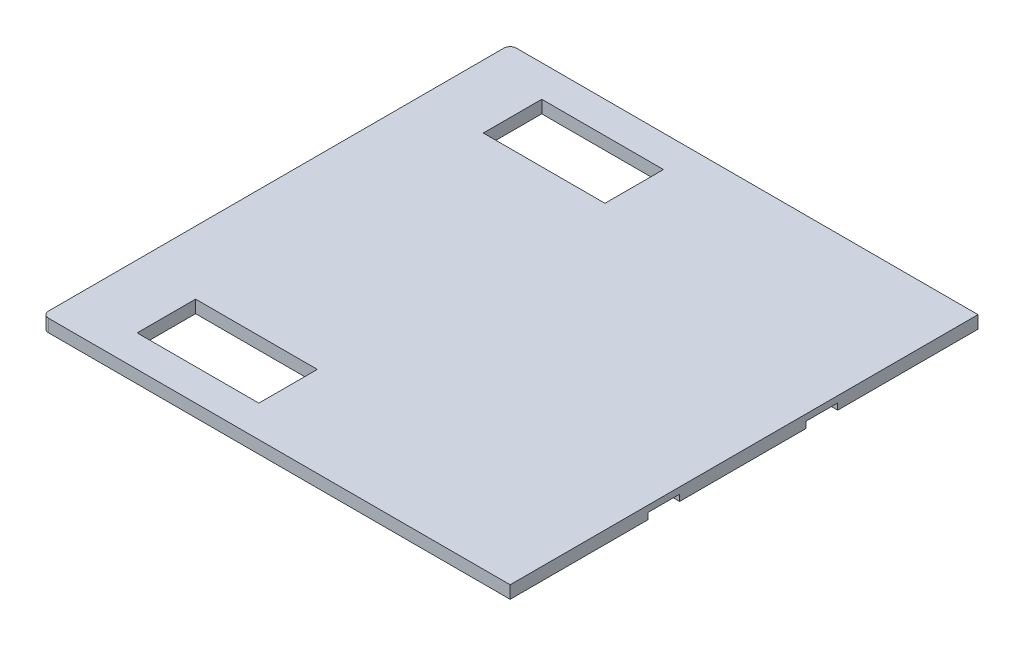
ISO-10303-21;
HEADER;
FILE_DESCRIPTION(('STEP AP214'),'2;1');
FILE_NAME('part.step','',(''),(''),'','','');
FILE_SCHEMA(('AUTOMOTIVE_DESIGN { 1 0 10303 214 1 1 1 1 }'));
ENDSEC;
DATA;
#1=APPLICATION_CONTEXT('core data for automotive mechanical design processes');
#2=APPLICATION_PROTOCOL_DEFINITION('international standard','automotive_design',2000,#1);
#3=PRODUCT_CONTEXT('',#1,'mechanical');
#4=PRODUCT('Part','Part','',(#3));
#5=PRODUCT_RELATED_PRODUCT_CATEGORY('part','',(#4));
#6=PRODUCT_DEFINITION_FORMATION('','',#4);
#7=PRODUCT_DEFINITION_CONTEXT('part definition',#1,'design');
#8=PRODUCT_DEFINITION('design','',#6,#7);
#9=PRODUCT_DEFINITION_SHAPE('','',#8);
#10=(LENGTH_UNIT() NAMED_UNIT(*) SI_UNIT(.MILLI.,.METRE.));
#11=(NAMED_UNIT(*) PLANE_ANGLE_UNIT() SI_UNIT($,.RADIAN.));
#12=(NAMED_UNIT(*) SI_UNIT($,.STERADIAN.) SOLID_ANGLE_UNIT());
#13=UNCERTAINTY_MEASURE_WITH_UNIT(LENGTH_MEASURE(1.E-05),#10,'distance_accuracy_value','');
#14=(GEOMETRIC_REPRESENTATION_CONTEXT(3) GLOBAL_UNCERTAINTY_ASSIGNED_CONTEXT((#13)) GLOBAL_UNIT_ASSIGNED_CONTEXT((#10,
#11,#12)) REPRESENTATION_CONTEXT('',''));
#15=CARTESIAN_POINT('',(0.,0.,0.));
#16=DIRECTION('',(0.,0.,1.));
#17=DIRECTION('',(1.,0.,0.));
#18=AXIS2_PLACEMENT_3D('',#15,#16,#17);
#19=CARTESIAN_POINT('',(0.,0.,0.));
#20=DIRECTION('',(0.,1.,0.));
#21=DIRECTION('',(0.,0.,1.));
#22=AXIS2_PLACEMENT_3D('',#19,#20,#21);
#23=PLANE('',#22);
#24=DIRECTION('',(0.,0.,1.));
#25=VECTOR('',#24,1.);
#26=CARTESIAN_POINT('',(-54.,0.,-64.));
#27=LINE('',#26,#25);
#28=CARTESIAN_POINT('',(-54.,0.,-64.));
#29=VERTEX_POINT('',#28);
#30=CARTESIAN_POINT('',(-54.,0.,-45.5));
#31=VERTEX_POINT('',#30);
#32=EDGE_CURVE('E56',#29,#31,#27,.T.);
#33=ORIENTED_EDGE('',*,*,#32,.T.);
#34=DIRECTION('',(1.,0.,0.));
#35=VECTOR('',#34,1.);
#36=CARTESIAN_POINT('',(-54.,0.,-45.5));
#37=LINE('',#36,#35);
#38=CARTESIAN_POINT('',(-15.5,0.,-45.5));
#39=VERTEX_POINT('',#38);
#40=EDGE_CURVE('E215',#31,#39,#37,.T.);
#41=ORIENTED_EDGE('',*,*,#40,.T.);
#42=DIRECTION('',(0.,0.,-1.));
#43=VECTOR('',#42,1.);
#44=CARTESIAN_POINT('',(-15.5,0.,-64.));
#45=LINE('',#44,#43);
#46=CARTESIAN_POINT('',(-15.5,0.,-64.));
#47=VERTEX_POINT('',#46);
#48=EDGE_CURVE('E218',#39,#47,#45,.T.);
#49=ORIENTED_EDGE('',*,*,#48,.T.);
#50=DIRECTION('',(-1.,0.,0.));
#51=VECTOR('',#50,1.);
#52=CARTESIAN_POINT('',(-54.,0.,-64.));
#53=LINE('',#52,#51);
#54=EDGE_CURVE('E221',#47,#29,#53,.T.);
#55=ORIENTED_EDGE('',*,*,#54,.T.);
#56=EDGE_LOOP('',(#33,#41,#49,#55));
#57=FACE_BOUND('',#56,.T.);
#58=DIRECTION('',(1.,0.,0.));
#59=VECTOR('',#58,1.);
#60=CARTESIAN_POINT('',(80.5611725248241,0.,30.3842184577749));
#61=LINE('',#60,#59);
#62=CARTESIAN_POINT('',(56.9201916936925,0.,30.3842184577749));
#63=VERTEX_POINT('',#62);
#64=CARTESIAN_POINT('',(74.,0.,30.3842184577749));
#65=VERTEX_POINT('',#64);
#66=EDGE_CURVE('E233',#63,#65,#61,.T.);
#67=ORIENTED_EDGE('',*,*,#66,.T.);
#68=DIRECTION('',(0.,0.,-1.));
#69=VECTOR('',#68,1.);
#70=CARTESIAN_POINT('',(74.,0.,-74.));
#71=LINE('',#70,#69);
#72=CARTESIAN_POINT('',(74.,0.,74.));
#73=VERTEX_POINT('',#72);
#74=EDGE_CURVE('E290',#73,#65,#71,.T.);
#75=ORIENTED_EDGE('',*,*,#74,.F.);
#76=DIRECTION('',(1.,0.,0.));
#77=VECTOR('',#76,1.);
#78=CARTESIAN_POINT('',(-74.,0.,74.));
#79=LINE('',#78,#77);
#80=CARTESIAN_POINT('',(-72.,0.,74.));
#81=VERTEX_POINT('',#80);
#82=EDGE_CURVE('E281',#81,#73,#79,.T.);
#83=ORIENTED_EDGE('',*,*,#82,.F.);
#84=CARTESIAN_POINT('',(-72.,0.,72.));
#85=DIRECTION('',(0.,1.,0.));
#86=DIRECTION('',(0.,0.,1.));
#87=AXIS2_PLACEMENT_3D('',#84,#85,#86);
#88=CIRCLE('',#87,2.);
#89=CARTESIAN_POINT('',(-74.,0.,72.));
#90=VERTEX_POINT('',#89);
#91=EDGE_CURVE('E311',#81,#90,#88,.F.);
#92=ORIENTED_EDGE('',*,*,#91,.T.);
#93=DIRECTION('',(0.,0.,1.));
#94=VECTOR('',#93,1.);
#95=CARTESIAN_POINT('',(-74.,0.,-74.));
#96=LINE('',#95,#94);
#97=CARTESIAN_POINT('',(-74.,0.,-72.));
#98=VERTEX_POINT('',#97);
#99=EDGE_CURVE('E297',#98,#90,#96,.T.);
#100=ORIENTED_EDGE('',*,*,#99,.F.);
#101=CARTESIAN_POINT('',(-72.,0.,-72.));
#102=DIRECTION('',(0.,1.,0.));
#103=DIRECTION('',(0.,0.,1.));
#104=AXIS2_PLACEMENT_3D('',#101,#102,#103);
#105=CIRCLE('',#104,2.);
#106=CARTESIAN_POINT('',(-72.,0.,-74.));
#107=VERTEX_POINT('',#106);
#108=EDGE_CURVE('E313',#98,#107,#105,.F.);
#109=ORIENTED_EDGE('',*,*,#108,.T.);
#110=DIRECTION('',(-1.,0.,0.));
#111=VECTOR('',#110,1.);
#112=CARTESIAN_POINT('',(-74.,0.,-74.));
#113=LINE('',#112,#111);
#114=CARTESIAN_POINT('',(74.,0.,-74.));
#115=VERTEX_POINT('',#114);
#116=EDGE_CURVE('E293',#115,#107,#113,.T.);
#117=ORIENTED_EDGE('',*,*,#116,.F.);
#118=CARTESIAN_POINT('',(74.,0.,-29.6157815422251));
#119=VERTEX_POINT('',#118);
#120=EDGE_CURVE('E276',#119,#115,#71,.T.);
#121=ORIENTED_EDGE('',*,*,#120,.F.);
#122=DIRECTION('',(1.,0.,0.));
#123=VECTOR('',#122,1.);
#124=CARTESIAN_POINT('',(0.,0.,-29.6157815422251));
#125=LINE('',#124,#123);
#126=CARTESIAN_POINT('',(56.9201916936925,0.,-29.6157815422251));
#127=VERTEX_POINT('',#126);
#128=EDGE_CURVE('E324',#127,#119,#125,.T.);
#129=ORIENTED_EDGE('',*,*,#128,.F.);
#130=DIRECTION('',(0.,0.,1.));
#131=VECTOR('',#130,1.);
#132=CARTESIAN_POINT('',(56.9201916936925,0.,-29.6157815422251));
#133=LINE('',#132,#131);
#134=CARTESIAN_POINT('',(56.9201916936925,0.,-19.6157815422251));
#135=VERTEX_POINT('',#134);
#136=EDGE_CURVE('E187',#127,#135,#133,.T.);
#137=ORIENTED_EDGE('',*,*,#136,.T.);
#138=DIRECTION('',(1.,0.,0.));
#139=VECTOR('',#138,1.);
#140=CARTESIAN_POINT('',(74.0521231631863,0.,-19.6157815422251));
#141=LINE('',#140,#139);
#142=CARTESIAN_POINT('',(74.,0.,-19.6157815422251));
#143=VERTEX_POINT('',#142);
#144=EDGE_CURVE('E255',#135,#143,#141,.T.);
#145=ORIENTED_EDGE('',*,*,#144,.T.);
#146=CARTESIAN_POINT('',(74.,0.,20.3842184577749));
#147=VERTEX_POINT('',#146);
#148=EDGE_CURVE('E294',#147,#143,#71,.T.);
#149=ORIENTED_EDGE('',*,*,#148,.F.);
#150=DIRECTION('',(1.,0.,0.));
#151=VECTOR('',#150,1.);
#152=CARTESIAN_POINT('',(0.,0.,20.3842184577749));
#153=LINE('',#152,#151);
#154=CARTESIAN_POINT('',(56.9201916936925,0.,20.3842184577749));
#155=VERTEX_POINT('',#154);
#156=EDGE_CURVE('E326',#155,#147,#153,.T.);
#157=ORIENTED_EDGE('',*,*,#156,.F.);
#158=DIRECTION('',(0.,0.,1.));
#159=VECTOR('',#158,1.);
#160=CARTESIAN_POINT('',(56.9201916936925,0.,20.3842184577749));
#161=LINE('',#160,#159);
#162=EDGE_CURVE('E239',#155,#63,#161,.T.);
#163=ORIENTED_EDGE('',*,*,#162,.T.);
#164=EDGE_LOOP('',(#67,#75,#83,#92,#100,#109,#117,#121,#129,#137,#145,#149,#157,#163));
#165=FACE_BOUND('',#164,.T.);
#166=DIRECTION('',(0.,0.,1.));
#167=VECTOR('',#166,1.);
#168=CARTESIAN_POINT('',(-54.,0.,64.));
#169=LINE('',#168,#167);
#170=CARTESIAN_POINT('',(-54.,0.,45.5));
#171=VERTEX_POINT('',#170);
#172=CARTESIAN_POINT('',(-54.,0.,64.));
#173=VERTEX_POINT('',#172);
#174=EDGE_CURVE('E48',#171,#173,#169,.T.);
#175=ORIENTED_EDGE('',*,*,#174,.T.);
#176=DIRECTION('',(1.,0.,0.));
#177=VECTOR('',#176,1.);
#178=CARTESIAN_POINT('',(-54.,0.,64.));
#179=LINE('',#178,#177);
#180=CARTESIAN_POINT('',(-15.5,0.,64.));
#181=VERTEX_POINT('',#180);
#182=EDGE_CURVE('E191',#173,#181,#179,.T.);
#183=ORIENTED_EDGE('',*,*,#182,.T.);
#184=DIRECTION('',(0.,0.,-1.));
#185=VECTOR('',#184,1.);
#186=CARTESIAN_POINT('',(-15.5,0.,64.));
#187=LINE('',#186,#185);
#188=CARTESIAN_POINT('',(-15.5,0.,45.5));
#189=VERTEX_POINT('',#188);
#190=EDGE_CURVE('E197',#181,#189,#187,.T.);
#191=ORIENTED_EDGE('',*,*,#190,.T.);
#192=DIRECTION('',(-1.,0.,0.));
#193=VECTOR('',#192,1.);
#194=CARTESIAN_POINT('',(-54.,0.,45.5));
#195=LINE('',#194,#193);
#196=EDGE_CURVE('E201',#189,#171,#195,.T.);
#197=ORIENTED_EDGE('',*,*,#196,.T.);
#198=EDGE_LOOP('',(#175,#183,#191,#197));
#199=FACE_BOUND('',#198,.T.);
#200=ADVANCED_FACE('F33',(#57,#165,#199),#23,.F.);
#201=CARTESIAN_POINT('',(0.,4.,0.));
#202=DIRECTION('',(0.,1.,0.));
#203=DIRECTION('',(0.,0.,1.));
#204=AXIS2_PLACEMENT_3D('',#201,#202,#203);
#205=PLANE('',#204);
#206=DIRECTION('',(-1.,0.,0.));
#207=VECTOR('',#206,1.);
#208=CARTESIAN_POINT('',(-74.,4.,-74.));
#209=LINE('',#208,#207);
#210=CARTESIAN_POINT('',(74.,4.,-74.));
#211=VERTEX_POINT('',#210);
#212=CARTESIAN_POINT('',(-72.,4.,-74.));
#213=VERTEX_POINT('',#212);
#214=EDGE_CURVE('E280',#211,#213,#209,.T.);
#215=ORIENTED_EDGE('',*,*,#214,.T.);
#216=CARTESIAN_POINT('',(-72.,4.,-72.));
#217=DIRECTION('',(0.,1.,0.));
#218=DIRECTION('',(0.,0.,1.));
#219=AXIS2_PLACEMENT_3D('',#216,#217,#218);
#220=CIRCLE('',#219,2.);
#221=CARTESIAN_POINT('',(-74.,4.,-72.));
#222=VERTEX_POINT('',#221);
#223=EDGE_CURVE('E319',#213,#222,#220,.T.);
#224=ORIENTED_EDGE('',*,*,#223,.T.);
#225=DIRECTION('',(0.,0.,1.));
#226=VECTOR('',#225,1.);
#227=CARTESIAN_POINT('',(-74.,4.,-74.));
#228=LINE('',#227,#226);
#229=CARTESIAN_POINT('',(-74.,4.,72.));
#230=VERTEX_POINT('',#229);
#231=EDGE_CURVE('E284',#222,#230,#228,.T.);
#232=ORIENTED_EDGE('',*,*,#231,.T.);
#233=CARTESIAN_POINT('',(-72.,4.,72.));
#234=DIRECTION('',(0.,1.,0.));
#235=DIRECTION('',(0.,0.,1.));
#236=AXIS2_PLACEMENT_3D('',#233,#234,#235);
#237=CIRCLE('',#236,2.);
#238=CARTESIAN_POINT('',(-72.,4.,74.));
#239=VERTEX_POINT('',#238);
#240=EDGE_CURVE('E317',#230,#239,#237,.T.);
#241=ORIENTED_EDGE('',*,*,#240,.T.);
#242=DIRECTION('',(1.,0.,0.));
#243=VECTOR('',#242,1.);
#244=CARTESIAN_POINT('',(-74.,4.,74.));
#245=LINE('',#244,#243);
#246=CARTESIAN_POINT('',(74.,4.,74.));
#247=VERTEX_POINT('',#246);
#248=EDGE_CURVE('E287',#239,#247,#245,.T.);
#249=ORIENTED_EDGE('',*,*,#248,.T.);
#250=DIRECTION('',(0.,0.,-1.));
#251=VECTOR('',#250,1.);
#252=CARTESIAN_POINT('',(74.,4.,-74.));
#253=LINE('',#252,#251);
#254=EDGE_CURVE('E277',#247,#211,#253,.T.);
#255=ORIENTED_EDGE('',*,*,#254,.T.);
#256=EDGE_LOOP('',(#215,#224,#232,#241,#249,#255));
#257=FACE_BOUND('',#256,.T.);
#258=DIRECTION('',(-1.,0.,0.));
#259=VECTOR('',#258,1.);
#260=CARTESIAN_POINT('',(0.,4.,-45.5));
#261=LINE('',#260,#259);
#262=CARTESIAN_POINT('',(-15.5,4.,-45.5));
#263=VERTEX_POINT('',#262);
#264=CARTESIAN_POINT('',(-54.,4.,-45.5));
#265=VERTEX_POINT('',#264);
#266=EDGE_CURVE('E338',#263,#265,#261,.T.);
#267=ORIENTED_EDGE('',*,*,#266,.T.);
#268=DIRECTION('',(0.,0.,-1.));
#269=VECTOR('',#268,1.);
#270=CARTESIAN_POINT('',(-54.,4.,0.));
#271=LINE('',#270,#269);
#272=CARTESIAN_POINT('',(-54.,4.,-64.));
#273=VERTEX_POINT('',#272);
#274=EDGE_CURVE('E341',#265,#273,#271,.T.);
#275=ORIENTED_EDGE('',*,*,#274,.T.);
#276=DIRECTION('',(1.,0.,0.));
#277=VECTOR('',#276,1.);
#278=CARTESIAN_POINT('',(0.,4.,-64.));
#279=LINE('',#278,#277);
#280=CARTESIAN_POINT('',(-15.5,4.,-64.));
#281=VERTEX_POINT('',#280);
#282=EDGE_CURVE('E332',#273,#281,#279,.T.);
#283=ORIENTED_EDGE('',*,*,#282,.T.);
#284=DIRECTION('',(0.,0.,1.));
#285=VECTOR('',#284,1.);
#286=CARTESIAN_POINT('',(-15.5,4.,0.));
#287=LINE('',#286,#285);
#288=EDGE_CURVE('E335',#281,#263,#287,.T.);
#289=ORIENTED_EDGE('',*,*,#288,.T.);
#290=EDGE_LOOP('',(#267,#275,#283,#289));
#291=FACE_BOUND('',#290,.T.);
#292=DIRECTION('',(-1.,0.,0.));
#293=VECTOR('',#292,1.);
#294=CARTESIAN_POINT('',(0.,4.,64.));
#295=LINE('',#294,#293);
#296=CARTESIAN_POINT('',(-15.5,4.,64.));
#297=VERTEX_POINT('',#296);
#298=CARTESIAN_POINT('',(-54.,4.,64.));
#299=VERTEX_POINT('',#298);
#300=EDGE_CURVE('E41',#297,#299,#295,.T.);
#301=ORIENTED_EDGE('',*,*,#300,.T.);
#302=DIRECTION('',(0.,0.,-1.));
#303=VECTOR('',#302,1.);
#304=CARTESIAN_POINT('',(-54.,4.,0.));
#305=LINE('',#304,#303);
#306=CARTESIAN_POINT('',(-54.,4.,45.5));
#307=VERTEX_POINT('',#306);
#308=EDGE_CURVE('E11',#299,#307,#305,.T.);
#309=ORIENTED_EDGE('',*,*,#308,.T.);
#310=DIRECTION('',(1.,0.,0.));
#311=VECTOR('',#310,1.);
#312=CARTESIAN_POINT('',(0.,4.,45.5));
#313=LINE('',#312,#311);
#314=CARTESIAN_POINT('',(-15.5,4.,45.5));
#315=VERTEX_POINT('',#314);
#316=EDGE_CURVE('E344',#307,#315,#313,.T.);
#317=ORIENTED_EDGE('',*,*,#316,.T.);
#318=DIRECTION('',(0.,0.,1.));
#319=VECTOR('',#318,1.);
#320=CARTESIAN_POINT('',(-15.5,4.,0.));
#321=LINE('',#320,#319);
#322=EDGE_CURVE('E347',#315,#297,#321,.T.);
#323=ORIENTED_EDGE('',*,*,#322,.T.);
#324=EDGE_LOOP('',(#301,#309,#317,#323));
#325=FACE_BOUND('',#324,.T.);
#326=ADVANCED_FACE('F350',(#257,#291,#325),#205,.T.);
#327=CARTESIAN_POINT('',(74.,4.,-74.));
#328=DIRECTION('',(-1.,0.,0.));
#329=DIRECTION('',(0.,0.,1.));
#330=AXIS2_PLACEMENT_3D('',#327,#328,#329);
#331=PLANE('',#330);
#332=DIRECTION('',(0.,-1.,0.));
#333=VECTOR('',#332,1.);
#334=CARTESIAN_POINT('',(74.,4.,30.3842184577749));
#335=LINE('',#334,#333);
#336=CARTESIAN_POINT('',(74.,2.,30.3842184577749));
#337=VERTEX_POINT('',#336);
#338=EDGE_CURVE('E274',#337,#65,#335,.T.);
#339=ORIENTED_EDGE('',*,*,#338,.F.);
#340=DIRECTION('',(0.,0.,1.));
#341=VECTOR('',#340,1.);
#342=CARTESIAN_POINT('',(74.,2.,-74.));
#343=LINE('',#342,#341);
#344=CARTESIAN_POINT('',(74.,2.,20.3842184577749));
#345=VERTEX_POINT('',#344);
#346=EDGE_CURVE('E330',#345,#337,#343,.T.);
#347=ORIENTED_EDGE('',*,*,#346,.F.);
#348=DIRECTION('',(0.,1.,0.));
#349=VECTOR('',#348,1.);
#350=CARTESIAN_POINT('',(74.,4.,20.3842184577749));
#351=LINE('',#350,#349);
#352=EDGE_CURVE('E272',#147,#345,#351,.T.);
#353=ORIENTED_EDGE('',*,*,#352,.F.);
#354=ORIENTED_EDGE('',*,*,#148,.T.);
#355=DIRECTION('',(0.,-1.,0.));
#356=VECTOR('',#355,1.);
#357=CARTESIAN_POINT('',(74.,4.,-19.6157815422251));
#358=LINE('',#357,#356);
#359=CARTESIAN_POINT('',(74.,2.,-19.6157815422251));
#360=VERTEX_POINT('',#359);
#361=EDGE_CURVE('E270',#360,#143,#358,.T.);
#362=ORIENTED_EDGE('',*,*,#361,.F.);
#363=DIRECTION('',(0.,0.,1.));
#364=VECTOR('',#363,1.);
#365=CARTESIAN_POINT('',(74.,2.,-74.));
#366=LINE('',#365,#364);
#367=CARTESIAN_POINT('',(74.,2.,-29.6157815422251));
#368=VERTEX_POINT('',#367);
#369=EDGE_CURVE('E328',#368,#360,#366,.T.);
#370=ORIENTED_EDGE('',*,*,#369,.F.);
#371=DIRECTION('',(0.,1.,0.));
#372=VECTOR('',#371,1.);
#373=CARTESIAN_POINT('',(74.,4.,-29.6157815422251));
#374=LINE('',#373,#372);
#375=EDGE_CURVE('E250',#119,#368,#374,.T.);
#376=ORIENTED_EDGE('',*,*,#375,.F.);
#377=ORIENTED_EDGE('',*,*,#120,.T.);
#378=DIRECTION('',(0.,-1.,0.));
#379=VECTOR('',#378,1.);
#380=CARTESIAN_POINT('',(74.,4.,-74.));
#381=LINE('',#380,#379);
#382=EDGE_CURVE('E303',#211,#115,#381,.T.);
#383=ORIENTED_EDGE('',*,*,#382,.F.);
#384=ORIENTED_EDGE('',*,*,#254,.F.);
#385=DIRECTION('',(0.,-1.,0.));
#386=VECTOR('',#385,1.);
#387=CARTESIAN_POINT('',(74.,4.,74.));
#388=LINE('',#387,#386);
#389=EDGE_CURVE('E289',#247,#73,#388,.T.);
#390=ORIENTED_EDGE('',*,*,#389,.T.);
#391=ORIENTED_EDGE('',*,*,#74,.T.);
#392=EDGE_LOOP('',(#339,#347,#353,#354,#362,#370,#376,#377,#383,#384,#390,#391));
#393=FACE_BOUND('',#392,.T.);
#394=ADVANCED_FACE('F368',(#393),#331,.F.);
#395=CARTESIAN_POINT('',(-74.,4.,-74.));
#396=DIRECTION('',(0.,0.,1.));
#397=DIRECTION('',(1.,0.,0.));
#398=AXIS2_PLACEMENT_3D('',#395,#396,#397);
#399=PLANE('',#398);
#400=ORIENTED_EDGE('',*,*,#116,.T.);
#401=DIRECTION('',(0.,-1.,0.));
#402=VECTOR('',#401,1.);
#403=CARTESIAN_POINT('',(-72.,4.,-74.));
#404=LINE('',#403,#402);
#405=EDGE_CURVE('E315',#107,#213,#404,.F.);
#406=ORIENTED_EDGE('',*,*,#405,.T.);
#407=ORIENTED_EDGE('',*,*,#214,.F.);
#408=ORIENTED_EDGE('',*,*,#382,.T.);
#409=EDGE_LOOP('',(#400,#406,#407,#408));
#410=FACE_BOUND('',#409,.T.);
#411=ADVANCED_FACE('F382',(#410),#399,.F.);
#412=CARTESIAN_POINT('',(-74.,4.,-74.));
#413=DIRECTION('',(1.,0.,0.));
#414=DIRECTION('',(0.,0.,-1.));
#415=AXIS2_PLACEMENT_3D('',#412,#413,#414);
#416=PLANE('',#415);
#417=ORIENTED_EDGE('',*,*,#231,.F.);
#418=DIRECTION('',(0.,-1.,0.));
#419=VECTOR('',#418,1.);
#420=CARTESIAN_POINT('',(-74.,4.,-72.));
#421=LINE('',#420,#419);
#422=EDGE_CURVE('E308',#222,#98,#421,.T.);
#423=ORIENTED_EDGE('',*,*,#422,.T.);
#424=ORIENTED_EDGE('',*,*,#99,.T.);
#425=DIRECTION('',(0.,-1.,0.));
#426=VECTOR('',#425,1.);
#427=CARTESIAN_POINT('',(-74.,4.,72.));
#428=LINE('',#427,#426);
#429=EDGE_CURVE('E306',#90,#230,#428,.F.);
#430=ORIENTED_EDGE('',*,*,#429,.T.);
#431=EDGE_LOOP('',(#417,#423,#424,#430));
#432=FACE_BOUND('',#431,.T.);
#433=ADVANCED_FACE('F378',(#432),#416,.F.);
#434=CARTESIAN_POINT('',(-74.,4.,74.));
#435=DIRECTION('',(0.,0.,-1.));
#436=DIRECTION('',(-1.,0.,0.));
#437=AXIS2_PLACEMENT_3D('',#434,#435,#436);
#438=PLANE('',#437);
#439=ORIENTED_EDGE('',*,*,#248,.F.);
#440=DIRECTION('',(0.,-1.,0.));
#441=VECTOR('',#440,1.);
#442=CARTESIAN_POINT('',(-72.,4.,74.));
#443=LINE('',#442,#441);
#444=EDGE_CURVE('E321',#239,#81,#443,.T.);
#445=ORIENTED_EDGE('',*,*,#444,.T.);
#446=ORIENTED_EDGE('',*,*,#82,.T.);
#447=ORIENTED_EDGE('',*,*,#389,.F.);
#448=EDGE_LOOP('',(#439,#445,#446,#447));
#449=FACE_BOUND('',#448,.T.);
#450=ADVANCED_FACE('F374',(#449),#438,.F.);
#451=CARTESIAN_POINT('',(-72.,4.,-72.));
#452=DIRECTION('',(0.,-1.,0.));
#453=DIRECTION('',(0.,0.,-1.));
#454=AXIS2_PLACEMENT_3D('',#451,#452,#453);
#455=CYLINDRICAL_SURFACE('',#454,2.);
#456=ORIENTED_EDGE('',*,*,#223,.F.);
#457=ORIENTED_EDGE('',*,*,#405,.F.);
#458=ORIENTED_EDGE('',*,*,#108,.F.);
#459=ORIENTED_EDGE('',*,*,#422,.F.);
#460=EDGE_LOOP('',(#456,#457,#458,#459));
#461=FACE_BOUND('',#460,.T.);
#462=ADVANCED_FACE('F377',(#461),#455,.T.);
#463=CARTESIAN_POINT('',(-72.,4.,72.));
#464=DIRECTION('',(0.,-1.,0.));
#465=DIRECTION('',(0.,0.,-1.));
#466=AXIS2_PLACEMENT_3D('',#463,#464,#465);
#467=CYLINDRICAL_SURFACE('',#466,2.);
#468=ORIENTED_EDGE('',*,*,#240,.F.);
#469=ORIENTED_EDGE('',*,*,#429,.F.);
#470=ORIENTED_EDGE('',*,*,#91,.F.);
#471=ORIENTED_EDGE('',*,*,#444,.F.);
#472=EDGE_LOOP('',(#468,#469,#470,#471));
#473=FACE_BOUND('',#472,.T.);
#474=ADVANCED_FACE('F35',(#473),#467,.T.);
#475=CARTESIAN_POINT('',(0.,2.,0.));
#476=DIRECTION('',(0.,-1.,0.));
#477=DIRECTION('',(0.,0.,-1.));
#478=AXIS2_PLACEMENT_3D('',#475,#476,#477);
#479=PLANE('',#478);
#480=ORIENTED_EDGE('',*,*,#369,.T.);
#481=DIRECTION('',(1.,0.,0.));
#482=VECTOR('',#481,1.);
#483=CARTESIAN_POINT('',(74.0521231631863,2.,-19.6157815422251));
#484=LINE('',#483,#482);
#485=CARTESIAN_POINT('',(56.9201916936925,2.,-19.6157815422251));
#486=VERTEX_POINT('',#485);
#487=EDGE_CURVE('E254',#486,#360,#484,.T.);
#488=ORIENTED_EDGE('',*,*,#487,.F.);
#489=DIRECTION('',(0.,0.,1.));
#490=VECTOR('',#489,1.);
#491=CARTESIAN_POINT('',(56.9201916936925,2.,-29.6157815422251));
#492=LINE('',#491,#490);
#493=CARTESIAN_POINT('',(56.9201916936925,2.,-29.6157815422251));
#494=VERTEX_POINT('',#493);
#495=EDGE_CURVE('E251',#494,#486,#492,.T.);
#496=ORIENTED_EDGE('',*,*,#495,.F.);
#497=DIRECTION('',(-1.,0.,0.));
#498=VECTOR('',#497,1.);
#499=CARTESIAN_POINT('',(74.0521231631863,2.,-29.6157815422251));
#500=LINE('',#499,#498);
#501=EDGE_CURVE('E258',#368,#494,#500,.T.);
#502=ORIENTED_EDGE('',*,*,#501,.F.);
#503=EDGE_LOOP('',(#480,#488,#496,#502));
#504=FACE_BOUND('',#503,.T.);
#505=ADVANCED_FACE('F394',(#504),#479,.T.);
#506=CARTESIAN_POINT('',(74.0521231631863,2.,-19.6157815422251));
#507=DIRECTION('',(0.,0.,-1.));
#508=DIRECTION('',(-1.,0.,0.));
#509=AXIS2_PLACEMENT_3D('',#506,#507,#508);
#510=PLANE('',#509);
#511=ORIENTED_EDGE('',*,*,#361,.T.);
#512=ORIENTED_EDGE('',*,*,#144,.F.);
#513=DIRECTION('',(0.,-1.,0.));
#514=VECTOR('',#513,1.);
#515=CARTESIAN_POINT('',(56.9201916936925,2.,-19.6157815422251));
#516=LINE('',#515,#514);
#517=EDGE_CURVE('E242',#486,#135,#516,.T.);
#518=ORIENTED_EDGE('',*,*,#517,.F.);
#519=ORIENTED_EDGE('',*,*,#487,.T.);
#520=EDGE_LOOP('',(#511,#512,#518,#519));
#521=FACE_BOUND('',#520,.T.);
#522=ADVANCED_FACE('F436',(#521),#510,.T.);
#523=CARTESIAN_POINT('',(74.0521231631863,2.,-29.6157815422251));
#524=DIRECTION('',(0.,0.,1.));
#525=DIRECTION('',(1.,0.,0.));
#526=AXIS2_PLACEMENT_3D('',#523,#524,#525);
#527=PLANE('',#526);
#528=ORIENTED_EDGE('',*,*,#375,.T.);
#529=ORIENTED_EDGE('',*,*,#501,.T.);
#530=DIRECTION('',(0.,-1.,0.));
#531=VECTOR('',#530,1.);
#532=CARTESIAN_POINT('',(56.9201916936925,2.,-29.6157815422251));
#533=LINE('',#532,#531);
#534=EDGE_CURVE('E260',#494,#127,#533,.T.);
#535=ORIENTED_EDGE('',*,*,#534,.T.);
#536=ORIENTED_EDGE('',*,*,#128,.T.);
#537=EDGE_LOOP('',(#528,#529,#535,#536));
#538=FACE_BOUND('',#537,.T.);
#539=ADVANCED_FACE('F445',(#538),#527,.T.);
#540=CARTESIAN_POINT('',(56.9201916936925,2.,-29.6157815422251));
#541=DIRECTION('',(1.,0.,0.));
#542=DIRECTION('',(0.,0.,-1.));
#543=AXIS2_PLACEMENT_3D('',#540,#541,#542);
#544=PLANE('',#543);
#545=ORIENTED_EDGE('',*,*,#136,.F.);
#546=ORIENTED_EDGE('',*,*,#534,.F.);
#547=ORIENTED_EDGE('',*,*,#495,.T.);
#548=ORIENTED_EDGE('',*,*,#517,.T.);
#549=EDGE_LOOP('',(#545,#546,#547,#548));
#550=FACE_BOUND('',#549,.T.);
#551=ADVANCED_FACE('F443',(#550),#544,.T.);
#552=CARTESIAN_POINT('',(0.,2.,0.));
#553=DIRECTION('',(0.,-1.,0.));
#554=DIRECTION('',(0.,0.,-1.));
#555=AXIS2_PLACEMENT_3D('',#552,#553,#554);
#556=PLANE('',#555);
#557=ORIENTED_EDGE('',*,*,#346,.T.);
#558=DIRECTION('',(1.,0.,0.));
#559=VECTOR('',#558,1.);
#560=CARTESIAN_POINT('',(80.5611725248241,2.,30.3842184577749));
#561=LINE('',#560,#559);
#562=CARTESIAN_POINT('',(56.9201916936925,2.,30.3842184577749));
#563=VERTEX_POINT('',#562);
#564=EDGE_CURVE('E232',#563,#337,#561,.T.);
#565=ORIENTED_EDGE('',*,*,#564,.F.);
#566=DIRECTION('',(0.,0.,1.));
#567=VECTOR('',#566,1.);
#568=CARTESIAN_POINT('',(56.9201916936925,2.,20.3842184577749));
#569=LINE('',#568,#567);
#570=CARTESIAN_POINT('',(56.9201916936925,2.,20.3842184577749));
#571=VERTEX_POINT('',#570);
#572=EDGE_CURVE('E229',#571,#563,#569,.T.);
#573=ORIENTED_EDGE('',*,*,#572,.F.);
#574=DIRECTION('',(-1.,0.,0.));
#575=VECTOR('',#574,1.);
#576=CARTESIAN_POINT('',(80.5611725248241,2.,20.3842184577749));
#577=LINE('',#576,#575);
#578=EDGE_CURVE('E236',#345,#571,#577,.T.);
#579=ORIENTED_EDGE('',*,*,#578,.F.);
#580=EDGE_LOOP('',(#557,#565,#573,#579));
#581=FACE_BOUND('',#580,.T.);
#582=ADVANCED_FACE('F423',(#581),#556,.T.);
#583=CARTESIAN_POINT('',(80.5611725248241,2.,30.3842184577749));
#584=DIRECTION('',(0.,0.,-1.));
#585=DIRECTION('',(-1.,0.,0.));
#586=AXIS2_PLACEMENT_3D('',#583,#584,#585);
#587=PLANE('',#586);
#588=ORIENTED_EDGE('',*,*,#338,.T.);
#589=ORIENTED_EDGE('',*,*,#66,.F.);
#590=DIRECTION('',(0.,-1.,0.));
#591=VECTOR('',#590,1.);
#592=CARTESIAN_POINT('',(56.9201916936925,2.,30.3842184577749));
#593=LINE('',#592,#591);
#594=EDGE_CURVE('E247',#563,#63,#593,.T.);
#595=ORIENTED_EDGE('',*,*,#594,.F.);
#596=ORIENTED_EDGE('',*,*,#564,.T.);
#597=EDGE_LOOP('',(#588,#589,#595,#596));
#598=FACE_BOUND('',#597,.T.);
#599=ADVANCED_FACE('F419',(#598),#587,.T.);
#600=CARTESIAN_POINT('',(80.5611725248241,2.,20.3842184577749));
#601=DIRECTION('',(0.,0.,1.));
#602=DIRECTION('',(1.,0.,0.));
#603=AXIS2_PLACEMENT_3D('',#600,#601,#602);
#604=PLANE('',#603);
#605=ORIENTED_EDGE('',*,*,#352,.T.);
#606=ORIENTED_EDGE('',*,*,#578,.T.);
#607=DIRECTION('',(0.,-1.,0.));
#608=VECTOR('',#607,1.);
#609=CARTESIAN_POINT('',(56.9201916936925,2.,20.3842184577749));
#610=LINE('',#609,#608);
#611=EDGE_CURVE('E238',#571,#155,#610,.T.);
#612=ORIENTED_EDGE('',*,*,#611,.T.);
#613=ORIENTED_EDGE('',*,*,#156,.T.);
#614=EDGE_LOOP('',(#605,#606,#612,#613));
#615=FACE_BOUND('',#614,.T.);
#616=ADVANCED_FACE('F430',(#615),#604,.T.);
#617=CARTESIAN_POINT('',(56.9201916936925,2.,20.3842184577749));
#618=DIRECTION('',(1.,0.,0.));
#619=DIRECTION('',(0.,0.,-1.));
#620=AXIS2_PLACEMENT_3D('',#617,#618,#619);
#621=PLANE('',#620);
#622=ORIENTED_EDGE('',*,*,#162,.F.);
#623=ORIENTED_EDGE('',*,*,#611,.F.);
#624=ORIENTED_EDGE('',*,*,#572,.T.);
#625=ORIENTED_EDGE('',*,*,#594,.T.);
#626=EDGE_LOOP('',(#622,#623,#624,#625));
#627=FACE_BOUND('',#626,.T.);
#628=ADVANCED_FACE('F427',(#627),#621,.T.);
#629=CARTESIAN_POINT('',(-54.,5.,-64.));
#630=DIRECTION('',(1.,0.,0.));
#631=DIRECTION('',(0.,0.,-1.));
#632=AXIS2_PLACEMENT_3D('',#629,#630,#631);
#633=PLANE('',#632);
#634=DIRECTION('',(0.,-1.,0.));
#635=VECTOR('',#634,1.);
#636=CARTESIAN_POINT('',(-54.,5.,-45.5));
#637=LINE('',#636,#635);
#638=EDGE_CURVE('E202',#265,#31,#637,.T.);
#639=ORIENTED_EDGE('',*,*,#638,.T.);
#640=ORIENTED_EDGE('',*,*,#32,.F.);
#641=DIRECTION('',(0.,-1.,0.));
#642=VECTOR('',#641,1.);
#643=CARTESIAN_POINT('',(-54.,5.,-64.));
#644=LINE('',#643,#642);
#645=EDGE_CURVE('E224',#273,#29,#644,.T.);
#646=ORIENTED_EDGE('',*,*,#645,.F.);
#647=ORIENTED_EDGE('',*,*,#274,.F.);
#648=EDGE_LOOP('',(#639,#640,#646,#647));
#649=FACE_BOUND('',#648,.T.);
#650=ADVANCED_FACE('F458',(#649),#633,.T.);
#651=CARTESIAN_POINT('',(-54.,5.,-45.5));
#652=DIRECTION('',(0.,0.,-1.));
#653=DIRECTION('',(-1.,0.,0.));
#654=AXIS2_PLACEMENT_3D('',#651,#652,#653);
#655=PLANE('',#654);
#656=DIRECTION('',(0.,-1.,0.));
#657=VECTOR('',#656,1.);
#658=CARTESIAN_POINT('',(-15.5,5.,-45.5));
#659=LINE('',#658,#657);
#660=EDGE_CURVE('E204',#263,#39,#659,.T.);
#661=ORIENTED_EDGE('',*,*,#660,.T.);
#662=ORIENTED_EDGE('',*,*,#40,.F.);
#663=ORIENTED_EDGE('',*,*,#638,.F.);
#664=ORIENTED_EDGE('',*,*,#266,.F.);
#665=EDGE_LOOP('',(#661,#662,#663,#664));
#666=FACE_BOUND('',#665,.T.);
#667=ADVANCED_FACE('F467',(#666),#655,.T.);
#668=CARTESIAN_POINT('',(-15.5,5.,-64.));
#669=DIRECTION('',(-1.,0.,0.));
#670=DIRECTION('',(0.,0.,1.));
#671=AXIS2_PLACEMENT_3D('',#668,#669,#670);
#672=PLANE('',#671);
#673=DIRECTION('',(0.,-1.,0.));
#674=VECTOR('',#673,1.);
#675=CARTESIAN_POINT('',(-15.5,5.,-64.));
#676=LINE('',#675,#674);
#677=EDGE_CURVE('E226',#281,#47,#676,.T.);
#678=ORIENTED_EDGE('',*,*,#677,.T.);
#679=ORIENTED_EDGE('',*,*,#48,.F.);
#680=ORIENTED_EDGE('',*,*,#660,.F.);
#681=ORIENTED_EDGE('',*,*,#288,.F.);
#682=EDGE_LOOP('',(#678,#679,#680,#681));
#683=FACE_BOUND('',#682,.T.);
#684=ADVANCED_FACE('F470',(#683),#672,.T.);
#685=CARTESIAN_POINT('',(-54.,5.,-64.));
#686=DIRECTION('',(0.,0.,1.));
#687=DIRECTION('',(1.,0.,0.));
#688=AXIS2_PLACEMENT_3D('',#685,#686,#687);
#689=PLANE('',#688);
#690=ORIENTED_EDGE('',*,*,#645,.T.);
#691=ORIENTED_EDGE('',*,*,#54,.F.);
#692=ORIENTED_EDGE('',*,*,#677,.F.);
#693=ORIENTED_EDGE('',*,*,#282,.F.);
#694=EDGE_LOOP('',(#690,#691,#692,#693));
#695=FACE_BOUND('',#694,.T.);
#696=ADVANCED_FACE('F474',(#695),#689,.T.);
#697=CARTESIAN_POINT('',(-54.,5.,64.));
#698=DIRECTION('',(1.,0.,0.));
#699=DIRECTION('',(0.,0.,-1.));
#700=AXIS2_PLACEMENT_3D('',#697,#698,#699);
#701=PLANE('',#700);
#702=DIRECTION('',(0.,-1.,0.));
#703=VECTOR('',#702,1.);
#704=CARTESIAN_POINT('',(-54.,5.,64.));
#705=LINE('',#704,#703);
#706=EDGE_CURVE('E182',#299,#173,#705,.T.);
#707=ORIENTED_EDGE('',*,*,#706,.T.);
#708=ORIENTED_EDGE('',*,*,#174,.F.);
#709=DIRECTION('',(0.,-1.,0.));
#710=VECTOR('',#709,1.);
#711=CARTESIAN_POINT('',(-54.,5.,45.5));
#712=LINE('',#711,#710);
#713=EDGE_CURVE('E209',#307,#171,#712,.T.);
#714=ORIENTED_EDGE('',*,*,#713,.F.);
#715=ORIENTED_EDGE('',*,*,#308,.F.);
#716=EDGE_LOOP('',(#707,#708,#714,#715));
#717=FACE_BOUND('',#716,.T.);
#718=ADVANCED_FACE('F184',(#717),#701,.T.);
#719=CARTESIAN_POINT('',(-54.,5.,64.));
#720=DIRECTION('',(0.,0.,-1.));
#721=DIRECTION('',(-1.,0.,0.));
#722=AXIS2_PLACEMENT_3D('',#719,#720,#721);
#723=PLANE('',#722);
#724=DIRECTION('',(0.,-1.,0.));
#725=VECTOR('',#724,1.);
#726=CARTESIAN_POINT('',(-15.5,5.,64.));
#727=LINE('',#726,#725);
#728=EDGE_CURVE('E188',#297,#181,#727,.T.);
#729=ORIENTED_EDGE('',*,*,#728,.T.);
#730=ORIENTED_EDGE('',*,*,#182,.F.);
#731=ORIENTED_EDGE('',*,*,#706,.F.);
#732=ORIENTED_EDGE('',*,*,#300,.F.);
#733=EDGE_LOOP('',(#729,#730,#731,#732));
#734=FACE_BOUND('',#733,.T.);
#735=ADVANCED_FACE('F192',(#734),#723,.T.);
#736=CARTESIAN_POINT('',(-15.5,5.,64.));
#737=DIRECTION('',(-1.,0.,0.));
#738=DIRECTION('',(0.,0.,1.));
#739=AXIS2_PLACEMENT_3D('',#736,#737,#738);
#740=PLANE('',#739);
#741=DIRECTION('',(0.,-1.,0.));
#742=VECTOR('',#741,1.);
#743=CARTESIAN_POINT('',(-15.5,5.,45.5));
#744=LINE('',#743,#742);
#745=EDGE_CURVE('E211',#315,#189,#744,.T.);
#746=ORIENTED_EDGE('',*,*,#745,.T.);
#747=ORIENTED_EDGE('',*,*,#190,.F.);
#748=ORIENTED_EDGE('',*,*,#728,.F.);
#749=ORIENTED_EDGE('',*,*,#322,.F.);
#750=EDGE_LOOP('',(#746,#747,#748,#749));
#751=FACE_BOUND('',#750,.T.);
#752=ADVANCED_FACE('F353',(#751),#740,.T.);
#753=CARTESIAN_POINT('',(-54.,5.,45.5));
#754=DIRECTION('',(0.,0.,1.));
#755=DIRECTION('',(1.,0.,0.));
#756=AXIS2_PLACEMENT_3D('',#753,#754,#755);
#757=PLANE('',#756);
#758=ORIENTED_EDGE('',*,*,#713,.T.);
#759=ORIENTED_EDGE('',*,*,#196,.F.);
#760=ORIENTED_EDGE('',*,*,#745,.F.);
#761=ORIENTED_EDGE('',*,*,#316,.F.);
#762=EDGE_LOOP('',(#758,#759,#760,#761));
#763=FACE_BOUND('',#762,.T.);
#764=ADVANCED_FACE('F355',(#763),#757,.T.);
#765=CLOSED_SHELL('',(#200,#326,#394,#411,#433,#450,#462,#474,#505,#522,#539,#551,#582,#599,
#616,#628,#650,#667,#684,#696,#718,#735,#752,#764));
#766=MANIFOLD_SOLID_BREP('B2',#765);
#767=ADVANCED_BREP_SHAPE_REPRESENTATION('',(#18,#766),#14);
#768=SHAPE_DEFINITION_REPRESENTATION(#9,#767);
ENDSEC;
END-ISO-10303-21;
